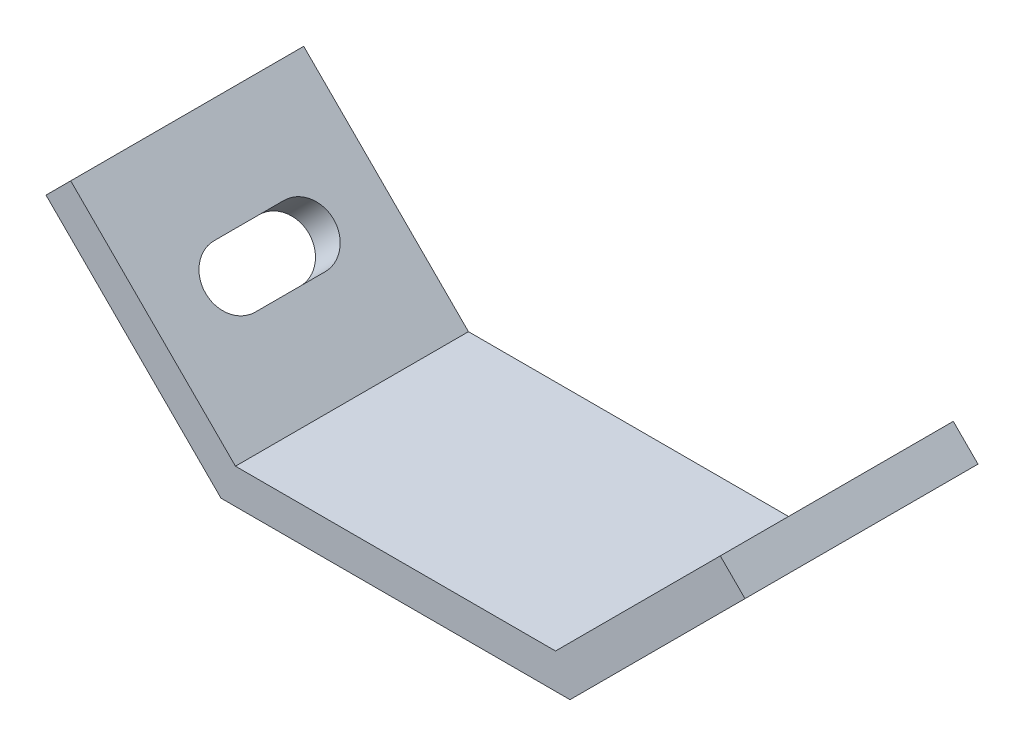
ISO-10303-21;
HEADER;
FILE_DESCRIPTION(('STEP AP214'),'2;1');
FILE_NAME('part.step','',(''),(''),'','','');
FILE_SCHEMA(('AUTOMOTIVE_DESIGN { 1 0 10303 214 1 1 1 1 }'));
ENDSEC;
DATA;
#1=APPLICATION_CONTEXT('core data for automotive mechanical design processes');
#2=APPLICATION_PROTOCOL_DEFINITION('international standard','automotive_design',2000,#1);
#3=PRODUCT_CONTEXT('',#1,'mechanical');
#4=PRODUCT('Part','Part','',(#3));
#5=PRODUCT_RELATED_PRODUCT_CATEGORY('part','',(#4));
#6=PRODUCT_DEFINITION_FORMATION('','',#4);
#7=PRODUCT_DEFINITION_CONTEXT('part definition',#1,'design');
#8=PRODUCT_DEFINITION('design','',#6,#7);
#9=PRODUCT_DEFINITION_SHAPE('','',#8);
#10=(LENGTH_UNIT() NAMED_UNIT(*) SI_UNIT(.MILLI.,.METRE.));
#11=(NAMED_UNIT(*) PLANE_ANGLE_UNIT() SI_UNIT($,.RADIAN.));
#12=(NAMED_UNIT(*) SI_UNIT($,.STERADIAN.) SOLID_ANGLE_UNIT());
#13=UNCERTAINTY_MEASURE_WITH_UNIT(LENGTH_MEASURE(1.E-05),#10,'distance_accuracy_value','');
#14=(GEOMETRIC_REPRESENTATION_CONTEXT(3) GLOBAL_UNCERTAINTY_ASSIGNED_CONTEXT((#13)) GLOBAL_UNIT_ASSIGNED_CONTEXT((#10,
#11,#12)) REPRESENTATION_CONTEXT('',''));
#15=CARTESIAN_POINT('',(0.,0.,0.));
#16=DIRECTION('',(0.,0.,1.));
#17=DIRECTION('',(1.,0.,0.));
#18=AXIS2_PLACEMENT_3D('',#15,#16,#17);
#19=CARTESIAN_POINT('',(15.8578643762691,-2.12132034355965,20.));
#20=DIRECTION('',(-0.707106781186546,0.707106781186549,0.));
#21=DIRECTION('',(-0.707106781186549,-0.707106781186546,0.));
#22=AXIS2_PLACEMENT_3D('',#19,#20,#21);
#23=PLANE('',#22);
#24=DIRECTION('',(0.707106781186549,0.707106781186546,0.));
#25=VECTOR('',#24,1.);
#26=CARTESIAN_POINT('',(15.8578643762691,-2.12132034355965,0.));
#27=LINE('',#26,#25);
#28=CARTESIAN_POINT('',(14.9791847198287,-3.,0.));
#29=VERTEX_POINT('',#28);
#30=CARTESIAN_POINT('',(30.,12.0208152801712,0.));
#31=VERTEX_POINT('',#30);
#32=EDGE_CURVE('E176',#29,#31,#27,.T.);
#33=ORIENTED_EDGE('',*,*,#32,.T.);
#34=DIRECTION('',(0.,0.,-1.));
#35=VECTOR('',#34,1.);
#36=CARTESIAN_POINT('',(30.,12.0208152801712,20.));
#37=LINE('',#36,#35);
#38=CARTESIAN_POINT('',(30.,12.0208152801712,20.));
#39=VERTEX_POINT('',#38);
#40=EDGE_CURVE('E241',#39,#31,#37,.T.);
#41=ORIENTED_EDGE('',*,*,#40,.F.);
#42=DIRECTION('',(0.707106781186549,0.707106781186546,0.));
#43=VECTOR('',#42,1.);
#44=CARTESIAN_POINT('',(15.8578643762691,-2.12132034355965,20.));
#45=LINE('',#44,#43);
#46=CARTESIAN_POINT('',(14.9791847198287,-3.,20.));
#47=VERTEX_POINT('',#46);
#48=EDGE_CURVE('E183',#47,#39,#45,.T.);
#49=ORIENTED_EDGE('',*,*,#48,.F.);
#50=DIRECTION('',(0.,0.,-1.));
#51=VECTOR('',#50,1.);
#52=CARTESIAN_POINT('',(14.9791847198287,-3.,20.));
#53=LINE('',#52,#51);
#54=EDGE_CURVE('E205',#47,#29,#53,.T.);
#55=ORIENTED_EDGE('',*,*,#54,.T.);
#56=EDGE_LOOP('',(#33,#41,#49,#55));
#57=FACE_BOUND('',#56,.T.);
#58=CARTESIAN_POINT('',(22.9289321881345,4.94974746830579,7.));
#59=DIRECTION('',(-0.707106781186546,0.707106781186549,0.));
#60=DIRECTION('',(-0.707106781186549,-0.707106781186546,0.));
#61=AXIS2_PLACEMENT_3D('',#58,#59,#60);
#62=CIRCLE('',#61,2.5);
#63=CARTESIAN_POINT('',(21.1611652351682,3.18198051533942,7.));
#64=VERTEX_POINT('',#63);
#65=CARTESIAN_POINT('',(24.6966991411009,6.71751442127216,7.));
#66=VERTEX_POINT('',#65);
#67=EDGE_CURVE('E160',#64,#66,#62,.F.);
#68=ORIENTED_EDGE('',*,*,#67,.F.);
#69=DIRECTION('',(0.,0.,-1.));
#70=VECTOR('',#69,1.);
#71=CARTESIAN_POINT('',(21.1611652351682,3.18198051533942,20.));
#72=LINE('',#71,#70);
#73=CARTESIAN_POINT('',(21.1611652351682,3.18198051533942,13.));
#74=VERTEX_POINT('',#73);
#75=EDGE_CURVE('E153',#74,#64,#72,.T.);
#76=ORIENTED_EDGE('',*,*,#75,.F.);
#77=CARTESIAN_POINT('',(22.9289321881345,4.94974746830579,13.));
#78=DIRECTION('',(-0.707106781186546,0.707106781186549,0.));
#79=DIRECTION('',(-0.707106781186549,-0.707106781186546,0.));
#80=AXIS2_PLACEMENT_3D('',#77,#78,#79);
#81=CIRCLE('',#80,2.5);
#82=CARTESIAN_POINT('',(24.6966991411009,6.71751442127216,13.));
#83=VERTEX_POINT('',#82);
#84=EDGE_CURVE('E134',#83,#74,#81,.F.);
#85=ORIENTED_EDGE('',*,*,#84,.F.);
#86=DIRECTION('',(0.,0.,1.));
#87=VECTOR('',#86,1.);
#88=CARTESIAN_POINT('',(24.6966991411009,6.71751442127216,20.));
#89=LINE('',#88,#87);
#90=EDGE_CURVE('E158',#66,#83,#89,.T.);
#91=ORIENTED_EDGE('',*,*,#90,.F.);
#92=EDGE_LOOP('',(#68,#76,#85,#91));
#93=FACE_BOUND('',#92,.T.);
#94=ADVANCED_FACE('F16',(#57,#93),#23,.F.);
#95=CARTESIAN_POINT('',(13.7365440327094,0.,20.));
#96=DIRECTION('',(-0.707106781186546,0.707106781186549,0.));
#97=DIRECTION('',(-0.707106781186549,-0.707106781186546,0.));
#98=AXIS2_PLACEMENT_3D('',#95,#96,#97);
#99=PLANE('',#98);
#100=DIRECTION('',(0.707106781186549,0.707106781186546,0.));
#101=VECTOR('',#100,1.);
#102=CARTESIAN_POINT('',(13.7365440327094,0.,0.));
#103=LINE('',#102,#101);
#104=CARTESIAN_POINT('',(13.7365440327094,0.,0.));
#105=VERTEX_POINT('',#104);
#106=CARTESIAN_POINT('',(27.8786796564404,14.1421356237309,0.));
#107=VERTEX_POINT('',#106);
#108=EDGE_CURVE('E211',#105,#107,#103,.T.);
#109=ORIENTED_EDGE('',*,*,#108,.F.);
#110=DIRECTION('',(0.,0.,-1.));
#111=VECTOR('',#110,1.);
#112=CARTESIAN_POINT('',(13.7365440327094,0.,20.));
#113=LINE('',#112,#111);
#114=CARTESIAN_POINT('',(13.7365440327094,0.,20.));
#115=VERTEX_POINT('',#114);
#116=EDGE_CURVE('E237',#115,#105,#113,.T.);
#117=ORIENTED_EDGE('',*,*,#116,.F.);
#118=DIRECTION('',(0.707106781186549,0.707106781186546,0.));
#119=VECTOR('',#118,1.);
#120=CARTESIAN_POINT('',(13.7365440327094,0.,20.));
#121=LINE('',#120,#119);
#122=CARTESIAN_POINT('',(27.8786796564404,14.1421356237309,20.));
#123=VERTEX_POINT('',#122);
#124=EDGE_CURVE('E189',#115,#123,#121,.T.);
#125=ORIENTED_EDGE('',*,*,#124,.T.);
#126=DIRECTION('',(0.,0.,-1.));
#127=VECTOR('',#126,1.);
#128=CARTESIAN_POINT('',(27.8786796564404,14.1421356237309,20.));
#129=LINE('',#128,#127);
#130=EDGE_CURVE('E239',#123,#107,#129,.T.);
#131=ORIENTED_EDGE('',*,*,#130,.T.);
#132=EDGE_LOOP('',(#109,#117,#125,#131));
#133=FACE_BOUND('',#132,.T.);
#134=DIRECTION('',(0.,0.,-1.));
#135=VECTOR('',#134,1.);
#136=CARTESIAN_POINT('',(19.0398448916085,5.30330085889907,7.));
#137=LINE('',#136,#135);
#138=CARTESIAN_POINT('',(19.0398448916085,5.30330085889907,13.));
#139=VERTEX_POINT('',#138);
#140=CARTESIAN_POINT('',(19.0398448916085,5.30330085889906,7.));
#141=VERTEX_POINT('',#140);
#142=EDGE_CURVE('E140',#139,#141,#137,.T.);
#143=ORIENTED_EDGE('',*,*,#142,.T.);
#144=CARTESIAN_POINT('',(20.8076118445749,7.07106781186544,7.));
#145=DIRECTION('',(0.707106781186546,-0.707106781186549,0.));
#146=DIRECTION('',(0.707106781186549,0.707106781186546,0.));
#147=AXIS2_PLACEMENT_3D('',#144,#145,#146);
#148=CIRCLE('',#147,2.5);
#149=CARTESIAN_POINT('',(22.5753787975413,8.8388347648318,7.));
#150=VERTEX_POINT('',#149);
#151=EDGE_CURVE('E38',#141,#150,#148,.T.);
#152=ORIENTED_EDGE('',*,*,#151,.T.);
#153=DIRECTION('',(0.,0.,1.));
#154=VECTOR('',#153,1.);
#155=CARTESIAN_POINT('',(22.5753787975413,8.8388347648318,7.));
#156=LINE('',#155,#154);
#157=CARTESIAN_POINT('',(22.5753787975413,8.83883476483181,13.));
#158=VERTEX_POINT('',#157);
#159=EDGE_CURVE('E146',#150,#158,#156,.T.);
#160=ORIENTED_EDGE('',*,*,#159,.T.);
#161=CARTESIAN_POINT('',(20.8076118445749,7.07106781186544,13.));
#162=DIRECTION('',(0.707106781186546,-0.707106781186549,0.));
#163=DIRECTION('',(0.707106781186549,0.707106781186546,0.));
#164=AXIS2_PLACEMENT_3D('',#161,#162,#163);
#165=CIRCLE('',#164,2.5);
#166=EDGE_CURVE('E131',#158,#139,#165,.T.);
#167=ORIENTED_EDGE('',*,*,#166,.T.);
#168=EDGE_LOOP('',(#143,#152,#160,#167));
#169=FACE_BOUND('',#168,.T.);
#170=ADVANCED_FACE('F144',(#133,#169),#99,.T.);
#171=CARTESIAN_POINT('',(27.8786796564404,14.1421356237309,20.));
#172=DIRECTION('',(0.707106781186549,0.707106781186546,0.));
#173=DIRECTION('',(-0.707106781186546,0.707106781186549,0.));
#174=AXIS2_PLACEMENT_3D('',#171,#172,#173);
#175=PLANE('',#174);
#176=DIRECTION('',(0.707106781186546,-0.707106781186549,0.));
#177=VECTOR('',#176,1.);
#178=CARTESIAN_POINT('',(27.8786796564404,14.1421356237309,0.));
#179=LINE('',#178,#177);
#180=EDGE_CURVE('E208',#107,#31,#179,.T.);
#181=ORIENTED_EDGE('',*,*,#180,.F.);
#182=ORIENTED_EDGE('',*,*,#130,.F.);
#183=DIRECTION('',(0.707106781186546,-0.707106781186549,0.));
#184=VECTOR('',#183,1.);
#185=CARTESIAN_POINT('',(27.8786796564404,14.1421356237309,20.));
#186=LINE('',#185,#184);
#187=EDGE_CURVE('E185',#123,#39,#186,.T.);
#188=ORIENTED_EDGE('',*,*,#187,.T.);
#189=ORIENTED_EDGE('',*,*,#40,.T.);
#190=EDGE_LOOP('',(#181,#182,#188,#189));
#191=FACE_BOUND('',#190,.T.);
#192=ADVANCED_FACE('F288',(#191),#175,.T.);
#193=CARTESIAN_POINT('',(-13.7365440327094,0.,20.));
#194=DIRECTION('',(0.,1.,0.));
#195=DIRECTION('',(-1.,0.,0.));
#196=AXIS2_PLACEMENT_3D('',#193,#194,#195);
#197=PLANE('',#196);
#198=DIRECTION('',(1.,0.,0.));
#199=VECTOR('',#198,1.);
#200=CARTESIAN_POINT('',(-13.7365440327094,0.,0.));
#201=LINE('',#200,#199);
#202=CARTESIAN_POINT('',(-13.7365440327094,0.,0.));
#203=VERTEX_POINT('',#202);
#204=EDGE_CURVE('E214',#203,#105,#201,.T.);
#205=ORIENTED_EDGE('',*,*,#204,.F.);
#206=DIRECTION('',(0.,0.,-1.));
#207=VECTOR('',#206,1.);
#208=CARTESIAN_POINT('',(-13.7365440327094,0.,20.));
#209=LINE('',#208,#207);
#210=CARTESIAN_POINT('',(-13.7365440327094,0.,20.));
#211=VERTEX_POINT('',#210);
#212=EDGE_CURVE('E235',#211,#203,#209,.T.);
#213=ORIENTED_EDGE('',*,*,#212,.F.);
#214=DIRECTION('',(1.,0.,0.));
#215=VECTOR('',#214,1.);
#216=CARTESIAN_POINT('',(-13.7365440327094,0.,20.));
#217=LINE('',#216,#215);
#218=EDGE_CURVE('E192',#211,#115,#217,.T.);
#219=ORIENTED_EDGE('',*,*,#218,.T.);
#220=ORIENTED_EDGE('',*,*,#116,.T.);
#221=EDGE_LOOP('',(#205,#213,#219,#220));
#222=FACE_BOUND('',#221,.T.);
#223=ADVANCED_FACE('F334',(#222),#197,.T.);
#224=CARTESIAN_POINT('',(-13.7365440327094,0.,20.));
#225=DIRECTION('',(0.707106781186546,0.707106781186549,0.));
#226=DIRECTION('',(-0.707106781186549,0.707106781186546,0.));
#227=AXIS2_PLACEMENT_3D('',#224,#225,#226);
#228=PLANE('',#227);
#229=CARTESIAN_POINT('',(-20.8076118445749,7.07106781186544,7.));
#230=DIRECTION('',(0.707106781186546,0.707106781186549,0.));
#231=DIRECTION('',(-0.707106781186549,0.707106781186546,0.));
#232=AXIS2_PLACEMENT_3D('',#229,#230,#231);
#233=CIRCLE('',#232,2.5);
#234=CARTESIAN_POINT('',(-19.0398448916085,5.30330085889907,7.));
#235=VERTEX_POINT('',#234);
#236=CARTESIAN_POINT('',(-22.5753787975413,8.8388347648318,7.));
#237=VERTEX_POINT('',#236);
#238=EDGE_CURVE('E162',#235,#237,#233,.T.);
#239=ORIENTED_EDGE('',*,*,#238,.F.);
#240=DIRECTION('',(0.,0.,-1.));
#241=VECTOR('',#240,1.);
#242=CARTESIAN_POINT('',(-19.0398448916085,5.30330085889907,7.));
#243=LINE('',#242,#241);
#244=CARTESIAN_POINT('',(-19.0398448916085,5.30330085889907,13.));
#245=VERTEX_POINT('',#244);
#246=EDGE_CURVE('E170',#245,#235,#243,.T.);
#247=ORIENTED_EDGE('',*,*,#246,.F.);
#248=CARTESIAN_POINT('',(-20.8076118445749,7.07106781186544,13.));
#249=DIRECTION('',(0.707106781186546,0.707106781186549,0.));
#250=DIRECTION('',(-0.707106781186549,0.707106781186546,0.));
#251=AXIS2_PLACEMENT_3D('',#248,#249,#250);
#252=CIRCLE('',#251,2.5);
#253=CARTESIAN_POINT('',(-22.5753787975413,8.83883476483181,13.));
#254=VERTEX_POINT('',#253);
#255=EDGE_CURVE('E167',#254,#245,#252,.T.);
#256=ORIENTED_EDGE('',*,*,#255,.F.);
#257=DIRECTION('',(0.,0.,1.));
#258=VECTOR('',#257,1.);
#259=CARTESIAN_POINT('',(-22.5753787975413,8.8388347648318,7.));
#260=LINE('',#259,#258);
#261=EDGE_CURVE('E164',#237,#254,#260,.T.);
#262=ORIENTED_EDGE('',*,*,#261,.F.);
#263=EDGE_LOOP('',(#239,#247,#256,#262));
#264=FACE_BOUND('',#263,.T.);
#265=DIRECTION('',(0.707106781186549,-0.707106781186546,0.));
#266=VECTOR('',#265,1.);
#267=CARTESIAN_POINT('',(-13.7365440327094,0.,0.));
#268=LINE('',#267,#266);
#269=CARTESIAN_POINT('',(-27.8786796564404,14.1421356237309,0.));
#270=VERTEX_POINT('',#269);
#271=EDGE_CURVE('E217',#270,#203,#268,.T.);
#272=ORIENTED_EDGE('',*,*,#271,.F.);
#273=DIRECTION('',(0.,0.,-1.));
#274=VECTOR('',#273,1.);
#275=CARTESIAN_POINT('',(-27.8786796564404,14.1421356237309,20.));
#276=LINE('',#275,#274);
#277=CARTESIAN_POINT('',(-27.8786796564404,14.1421356237309,20.));
#278=VERTEX_POINT('',#277);
#279=EDGE_CURVE('E233',#278,#270,#276,.T.);
#280=ORIENTED_EDGE('',*,*,#279,.F.);
#281=DIRECTION('',(0.707106781186549,-0.707106781186546,0.));
#282=VECTOR('',#281,1.);
#283=CARTESIAN_POINT('',(-13.7365440327094,0.,20.));
#284=LINE('',#283,#282);
#285=EDGE_CURVE('E195',#278,#211,#284,.T.);
#286=ORIENTED_EDGE('',*,*,#285,.T.);
#287=ORIENTED_EDGE('',*,*,#212,.T.);
#288=EDGE_LOOP('',(#272,#280,#286,#287));
#289=FACE_BOUND('',#288,.T.);
#290=ADVANCED_FACE('F264',(#264,#289),#228,.T.);
#291=CARTESIAN_POINT('',(-30.,12.0208152801712,20.));
#292=DIRECTION('',(-0.707106781186549,0.707106781186546,0.));
#293=DIRECTION('',(-0.707106781186546,-0.707106781186549,0.));
#294=AXIS2_PLACEMENT_3D('',#291,#292,#293);
#295=PLANE('',#294);
#296=DIRECTION('',(0.707106781186546,0.707106781186549,0.));
#297=VECTOR('',#296,1.);
#298=CARTESIAN_POINT('',(-30.,12.0208152801712,0.));
#299=LINE('',#298,#297);
#300=CARTESIAN_POINT('',(-30.,12.0208152801712,0.));
#301=VERTEX_POINT('',#300);
#302=EDGE_CURVE('E220',#301,#270,#299,.T.);
#303=ORIENTED_EDGE('',*,*,#302,.F.);
#304=DIRECTION('',(0.,0.,-1.));
#305=VECTOR('',#304,1.);
#306=CARTESIAN_POINT('',(-30.,12.0208152801712,20.));
#307=LINE('',#306,#305);
#308=CARTESIAN_POINT('',(-30.,12.0208152801712,20.));
#309=VERTEX_POINT('',#308);
#310=EDGE_CURVE('E231',#309,#301,#307,.T.);
#311=ORIENTED_EDGE('',*,*,#310,.F.);
#312=DIRECTION('',(0.707106781186546,0.707106781186549,0.));
#313=VECTOR('',#312,1.);
#314=CARTESIAN_POINT('',(-30.,12.0208152801712,20.));
#315=LINE('',#314,#313);
#316=EDGE_CURVE('E198',#309,#278,#315,.T.);
#317=ORIENTED_EDGE('',*,*,#316,.T.);
#318=ORIENTED_EDGE('',*,*,#279,.T.);
#319=EDGE_LOOP('',(#303,#311,#317,#318));
#320=FACE_BOUND('',#319,.T.);
#321=ADVANCED_FACE('F328',(#320),#295,.T.);
#322=CARTESIAN_POINT('',(-15.8578643762691,-2.12132034355965,20.));
#323=DIRECTION('',(0.707106781186546,0.707106781186549,0.));
#324=DIRECTION('',(-0.707106781186549,0.707106781186546,0.));
#325=AXIS2_PLACEMENT_3D('',#322,#323,#324);
#326=PLANE('',#325);
#327=DIRECTION('',(0.,0.,-1.));
#328=VECTOR('',#327,1.);
#329=CARTESIAN_POINT('',(-21.1611652351682,3.18198051533942,20.));
#330=LINE('',#329,#328);
#331=CARTESIAN_POINT('',(-21.1611652351682,3.18198051533942,13.));
#332=VERTEX_POINT('',#331);
#333=CARTESIAN_POINT('',(-21.1611652351682,3.18198051533942,7.));
#334=VERTEX_POINT('',#333);
#335=EDGE_CURVE('E23',#332,#334,#330,.T.);
#336=ORIENTED_EDGE('',*,*,#335,.T.);
#337=CARTESIAN_POINT('',(-22.9289321881345,4.94974746830579,7.));
#338=DIRECTION('',(0.707106781186546,0.707106781186549,0.));
#339=DIRECTION('',(-0.707106781186549,0.707106781186546,0.));
#340=AXIS2_PLACEMENT_3D('',#337,#338,#339);
#341=CIRCLE('',#340,2.5);
#342=CARTESIAN_POINT('',(-24.6966991411009,6.71751442127216,7.));
#343=VERTEX_POINT('',#342);
#344=EDGE_CURVE('E10',#334,#343,#341,.T.);
#345=ORIENTED_EDGE('',*,*,#344,.T.);
#346=DIRECTION('',(0.,0.,1.));
#347=VECTOR('',#346,1.);
#348=CARTESIAN_POINT('',(-24.6966991411009,6.71751442127216,20.));
#349=LINE('',#348,#347);
#350=CARTESIAN_POINT('',(-24.6966991411009,6.71751442127216,13.));
#351=VERTEX_POINT('',#350);
#352=EDGE_CURVE('E243',#343,#351,#349,.T.);
#353=ORIENTED_EDGE('',*,*,#352,.T.);
#354=CARTESIAN_POINT('',(-22.9289321881345,4.94974746830579,13.));
#355=DIRECTION('',(0.707106781186546,0.707106781186549,0.));
#356=DIRECTION('',(-0.707106781186549,0.707106781186546,0.));
#357=AXIS2_PLACEMENT_3D('',#354,#355,#356);
#358=CIRCLE('',#357,2.5);
#359=EDGE_CURVE('E246',#351,#332,#358,.T.);
#360=ORIENTED_EDGE('',*,*,#359,.T.);
#361=EDGE_LOOP('',(#336,#345,#353,#360));
#362=FACE_BOUND('',#361,.T.);
#363=DIRECTION('',(0.707106781186549,-0.707106781186546,0.));
#364=VECTOR('',#363,1.);
#365=CARTESIAN_POINT('',(-15.8578643762691,-2.12132034355965,0.));
#366=LINE('',#365,#364);
#367=CARTESIAN_POINT('',(-14.9791847198287,-3.,0.));
#368=VERTEX_POINT('',#367);
#369=EDGE_CURVE('E223',#301,#368,#366,.T.);
#370=ORIENTED_EDGE('',*,*,#369,.T.);
#371=DIRECTION('',(0.,0.,-1.));
#372=VECTOR('',#371,1.);
#373=CARTESIAN_POINT('',(-14.9791847198287,-3.,20.));
#374=LINE('',#373,#372);
#375=CARTESIAN_POINT('',(-14.9791847198287,-3.,20.));
#376=VERTEX_POINT('',#375);
#377=EDGE_CURVE('E228',#376,#368,#374,.T.);
#378=ORIENTED_EDGE('',*,*,#377,.F.);
#379=DIRECTION('',(0.707106781186549,-0.707106781186546,0.));
#380=VECTOR('',#379,1.);
#381=CARTESIAN_POINT('',(-15.8578643762691,-2.12132034355965,20.));
#382=LINE('',#381,#380);
#383=EDGE_CURVE('E201',#309,#376,#382,.T.);
#384=ORIENTED_EDGE('',*,*,#383,.F.);
#385=ORIENTED_EDGE('',*,*,#310,.T.);
#386=EDGE_LOOP('',(#370,#378,#384,#385));
#387=FACE_BOUND('',#386,.T.);
#388=ADVANCED_FACE('F250',(#362,#387),#326,.F.);
#389=CARTESIAN_POINT('',(-13.7365440327094,-3.,20.));
#390=DIRECTION('',(0.,1.,0.));
#391=DIRECTION('',(-1.,0.,0.));
#392=AXIS2_PLACEMENT_3D('',#389,#390,#391);
#393=PLANE('',#392);
#394=DIRECTION('',(1.,0.,0.));
#395=VECTOR('',#394,1.);
#396=CARTESIAN_POINT('',(-13.7365440327094,-3.,0.));
#397=LINE('',#396,#395);
#398=EDGE_CURVE('E186',#368,#29,#397,.T.);
#399=ORIENTED_EDGE('',*,*,#398,.T.);
#400=ORIENTED_EDGE('',*,*,#54,.F.);
#401=DIRECTION('',(1.,0.,0.));
#402=VECTOR('',#401,1.);
#403=CARTESIAN_POINT('',(-13.7365440327094,-3.,20.));
#404=LINE('',#403,#402);
#405=EDGE_CURVE('E203',#376,#47,#404,.T.);
#406=ORIENTED_EDGE('',*,*,#405,.F.);
#407=ORIENTED_EDGE('',*,*,#377,.T.);
#408=EDGE_LOOP('',(#399,#400,#406,#407));
#409=FACE_BOUND('',#408,.T.);
#410=ADVANCED_FACE('F320',(#409),#393,.F.);
#411=CARTESIAN_POINT('',(0.,0.,20.));
#412=DIRECTION('',(0.,0.,-1.));
#413=DIRECTION('',(-1.,0.,0.));
#414=AXIS2_PLACEMENT_3D('',#411,#412,#413);
#415=PLANE('',#414);
#416=ORIENTED_EDGE('',*,*,#48,.T.);
#417=ORIENTED_EDGE('',*,*,#187,.F.);
#418=ORIENTED_EDGE('',*,*,#124,.F.);
#419=ORIENTED_EDGE('',*,*,#218,.F.);
#420=ORIENTED_EDGE('',*,*,#285,.F.);
#421=ORIENTED_EDGE('',*,*,#316,.F.);
#422=ORIENTED_EDGE('',*,*,#383,.T.);
#423=ORIENTED_EDGE('',*,*,#405,.T.);
#424=EDGE_LOOP('',(#416,#417,#418,#419,#420,#421,#422,#423));
#425=FACE_BOUND('',#424,.T.);
#426=ADVANCED_FACE('F315',(#425),#415,.F.);
#427=CARTESIAN_POINT('',(0.,0.,0.));
#428=DIRECTION('',(0.,0.,-1.));
#429=DIRECTION('',(-1.,0.,0.));
#430=AXIS2_PLACEMENT_3D('',#427,#428,#429);
#431=PLANE('',#430);
#432=ORIENTED_EDGE('',*,*,#32,.F.);
#433=ORIENTED_EDGE('',*,*,#398,.F.);
#434=ORIENTED_EDGE('',*,*,#369,.F.);
#435=ORIENTED_EDGE('',*,*,#302,.T.);
#436=ORIENTED_EDGE('',*,*,#271,.T.);
#437=ORIENTED_EDGE('',*,*,#204,.T.);
#438=ORIENTED_EDGE('',*,*,#108,.T.);
#439=ORIENTED_EDGE('',*,*,#180,.T.);
#440=EDGE_LOOP('',(#432,#433,#434,#435,#436,#437,#438,#439));
#441=FACE_BOUND('',#440,.T.);
#442=ADVANCED_FACE('F311',(#441),#431,.T.);
#443=CARTESIAN_POINT('',(-30.4393398282201,-2.56066017177985,7.));
#444=DIRECTION('',(0.707106781186546,0.707106781186549,0.));
#445=DIRECTION('',(-0.707106781186549,0.707106781186546,0.));
#446=AXIS2_PLACEMENT_3D('',#443,#444,#445);
#447=CYLINDRICAL_SURFACE('',#446,2.5);
#448=DIRECTION('',(0.707106781186546,0.707106781186549,0.));
#449=VECTOR('',#448,1.);
#450=CARTESIAN_POINT('',(-28.6715728752538,-4.32842712474622,7.));
#451=LINE('',#450,#449);
#452=EDGE_CURVE('E174',#334,#235,#451,.T.);
#453=ORIENTED_EDGE('',*,*,#452,.T.);
#454=ORIENTED_EDGE('',*,*,#238,.T.);
#455=DIRECTION('',(0.707106781186546,0.707106781186549,0.));
#456=VECTOR('',#455,1.);
#457=CARTESIAN_POINT('',(-32.2071067811865,-0.792893218813486,7.));
#458=LINE('',#457,#456);
#459=EDGE_CURVE('E173',#343,#237,#458,.T.);
#460=ORIENTED_EDGE('',*,*,#459,.F.);
#461=ORIENTED_EDGE('',*,*,#344,.F.);
#462=EDGE_LOOP('',(#453,#454,#460,#461));
#463=FACE_BOUND('',#462,.T.);
#464=ADVANCED_FACE('F268',(#463),#447,.F.);
#465=CARTESIAN_POINT('',(-28.6715728752538,-4.32842712474622,7.));
#466=DIRECTION('',(0.707106781186549,-0.707106781186546,0.));
#467=DIRECTION('',(0.707106781186546,0.707106781186549,0.));
#468=AXIS2_PLACEMENT_3D('',#465,#466,#467);
#469=PLANE('',#468);
#470=DIRECTION('',(0.707106781186546,0.707106781186549,0.));
#471=VECTOR('',#470,1.);
#472=CARTESIAN_POINT('',(-28.6715728752538,-4.32842712474622,13.));
#473=LINE('',#472,#471);
#474=EDGE_CURVE('E177',#332,#245,#473,.T.);
#475=ORIENTED_EDGE('',*,*,#474,.T.);
#476=ORIENTED_EDGE('',*,*,#246,.T.);
#477=ORIENTED_EDGE('',*,*,#452,.F.);
#478=ORIENTED_EDGE('',*,*,#335,.F.);
#479=EDGE_LOOP('',(#475,#476,#477,#478));
#480=FACE_BOUND('',#479,.T.);
#481=ADVANCED_FACE('F256',(#480),#469,.F.);
#482=CARTESIAN_POINT('',(-30.4393398282201,-2.56066017177985,13.));
#483=DIRECTION('',(0.707106781186546,0.707106781186549,0.));
#484=DIRECTION('',(-0.707106781186549,0.707106781186546,0.));
#485=AXIS2_PLACEMENT_3D('',#482,#483,#484);
#486=CYLINDRICAL_SURFACE('',#485,2.5);
#487=DIRECTION('',(0.707106781186546,0.707106781186549,0.));
#488=VECTOR('',#487,1.);
#489=CARTESIAN_POINT('',(-32.2071067811865,-0.792893218813481,13.));
#490=LINE('',#489,#488);
#491=EDGE_CURVE('E179',#351,#254,#490,.T.);
#492=ORIENTED_EDGE('',*,*,#491,.T.);
#493=ORIENTED_EDGE('',*,*,#255,.T.);
#494=ORIENTED_EDGE('',*,*,#474,.F.);
#495=ORIENTED_EDGE('',*,*,#359,.F.);
#496=EDGE_LOOP('',(#492,#493,#494,#495));
#497=FACE_BOUND('',#496,.T.);
#498=ADVANCED_FACE('F258',(#497),#486,.F.);
#499=CARTESIAN_POINT('',(-32.2071067811865,-0.792893218813486,7.));
#500=DIRECTION('',(-0.707106781186549,0.707106781186546,0.));
#501=DIRECTION('',(-0.707106781186546,-0.707106781186549,0.));
#502=AXIS2_PLACEMENT_3D('',#499,#500,#501);
#503=PLANE('',#502);
#504=ORIENTED_EDGE('',*,*,#459,.T.);
#505=ORIENTED_EDGE('',*,*,#261,.T.);
#506=ORIENTED_EDGE('',*,*,#491,.F.);
#507=ORIENTED_EDGE('',*,*,#352,.F.);
#508=EDGE_LOOP('',(#504,#505,#506,#507));
#509=FACE_BOUND('',#508,.T.);
#510=ADVANCED_FACE('F270',(#509),#503,.F.);
#511=CARTESIAN_POINT('',(30.4393398282201,-2.56066017177985,7.));
#512=DIRECTION('',(-0.707106781186546,0.707106781186549,0.));
#513=DIRECTION('',(-0.707106781186549,-0.707106781186546,0.));
#514=AXIS2_PLACEMENT_3D('',#511,#512,#513);
#515=CYLINDRICAL_SURFACE('',#514,2.5);
#516=ORIENTED_EDGE('',*,*,#67,.T.);
#517=DIRECTION('',(-0.707106781186546,0.707106781186549,0.));
#518=VECTOR('',#517,1.);
#519=CARTESIAN_POINT('',(32.2071067811865,-0.792893218813486,7.));
#520=LINE('',#519,#518);
#521=EDGE_CURVE('E151',#66,#150,#520,.T.);
#522=ORIENTED_EDGE('',*,*,#521,.T.);
#523=ORIENTED_EDGE('',*,*,#151,.F.);
#524=DIRECTION('',(-0.707106781186546,0.707106781186549,0.));
#525=VECTOR('',#524,1.);
#526=CARTESIAN_POINT('',(28.6715728752538,-4.32842712474622,7.));
#527=LINE('',#526,#525);
#528=EDGE_CURVE('E137',#64,#141,#527,.T.);
#529=ORIENTED_EDGE('',*,*,#528,.F.);
#530=EDGE_LOOP('',(#516,#522,#523,#529));
#531=FACE_BOUND('',#530,.T.);
#532=ADVANCED_FACE('F272',(#531),#515,.F.);
#533=CARTESIAN_POINT('',(32.2071067811865,-0.792893218813486,7.));
#534=DIRECTION('',(-0.707106781186549,-0.707106781186546,0.));
#535=DIRECTION('',(0.707106781186546,-0.707106781186549,0.));
#536=AXIS2_PLACEMENT_3D('',#533,#534,#535);
#537=PLANE('',#536);
#538=ORIENTED_EDGE('',*,*,#90,.T.);
#539=DIRECTION('',(-0.707106781186546,0.707106781186549,0.));
#540=VECTOR('',#539,1.);
#541=CARTESIAN_POINT('',(32.2071067811865,-0.792893218813481,13.));
#542=LINE('',#541,#540);
#543=EDGE_CURVE('E136',#83,#158,#542,.T.);
#544=ORIENTED_EDGE('',*,*,#543,.T.);
#545=ORIENTED_EDGE('',*,*,#159,.F.);
#546=ORIENTED_EDGE('',*,*,#521,.F.);
#547=EDGE_LOOP('',(#538,#544,#545,#546));
#548=FACE_BOUND('',#547,.T.);
#549=ADVANCED_FACE('F279',(#548),#537,.T.);
#550=CARTESIAN_POINT('',(30.4393398282201,-2.56066017177985,13.));
#551=DIRECTION('',(-0.707106781186546,0.707106781186549,0.));
#552=DIRECTION('',(-0.707106781186549,-0.707106781186546,0.));
#553=AXIS2_PLACEMENT_3D('',#550,#551,#552);
#554=CYLINDRICAL_SURFACE('',#553,2.5);
#555=ORIENTED_EDGE('',*,*,#84,.T.);
#556=DIRECTION('',(-0.707106781186546,0.707106781186549,0.));
#557=VECTOR('',#556,1.);
#558=CARTESIAN_POINT('',(28.6715728752538,-4.32842712474622,13.));
#559=LINE('',#558,#557);
#560=EDGE_CURVE('E30',#74,#139,#559,.T.);
#561=ORIENTED_EDGE('',*,*,#560,.T.);
#562=ORIENTED_EDGE('',*,*,#166,.F.);
#563=ORIENTED_EDGE('',*,*,#543,.F.);
#564=EDGE_LOOP('',(#555,#561,#562,#563));
#565=FACE_BOUND('',#564,.T.);
#566=ADVANCED_FACE('F128',(#565),#554,.F.);
#567=CARTESIAN_POINT('',(28.6715728752538,-4.32842712474622,7.));
#568=DIRECTION('',(0.707106781186549,0.707106781186546,0.));
#569=DIRECTION('',(-0.707106781186546,0.707106781186549,0.));
#570=AXIS2_PLACEMENT_3D('',#567,#568,#569);
#571=PLANE('',#570);
#572=ORIENTED_EDGE('',*,*,#75,.T.);
#573=ORIENTED_EDGE('',*,*,#528,.T.);
#574=ORIENTED_EDGE('',*,*,#142,.F.);
#575=ORIENTED_EDGE('',*,*,#560,.F.);
#576=EDGE_LOOP('',(#572,#573,#574,#575));
#577=FACE_BOUND('',#576,.T.);
#578=ADVANCED_FACE('F141',(#577),#571,.T.);
#579=CLOSED_SHELL('',(#94,#170,#192,#223,#290,#321,#388,#410,#426,#442,#464,#481,#498,#510,#532,
#549,#566,#578));
#580=MANIFOLD_SOLID_BREP('B1',#579);
#581=ADVANCED_BREP_SHAPE_REPRESENTATION('',(#18,#580),#14);
#582=SHAPE_DEFINITION_REPRESENTATION(#9,#581);
ENDSEC;
END-ISO-10303-21;
